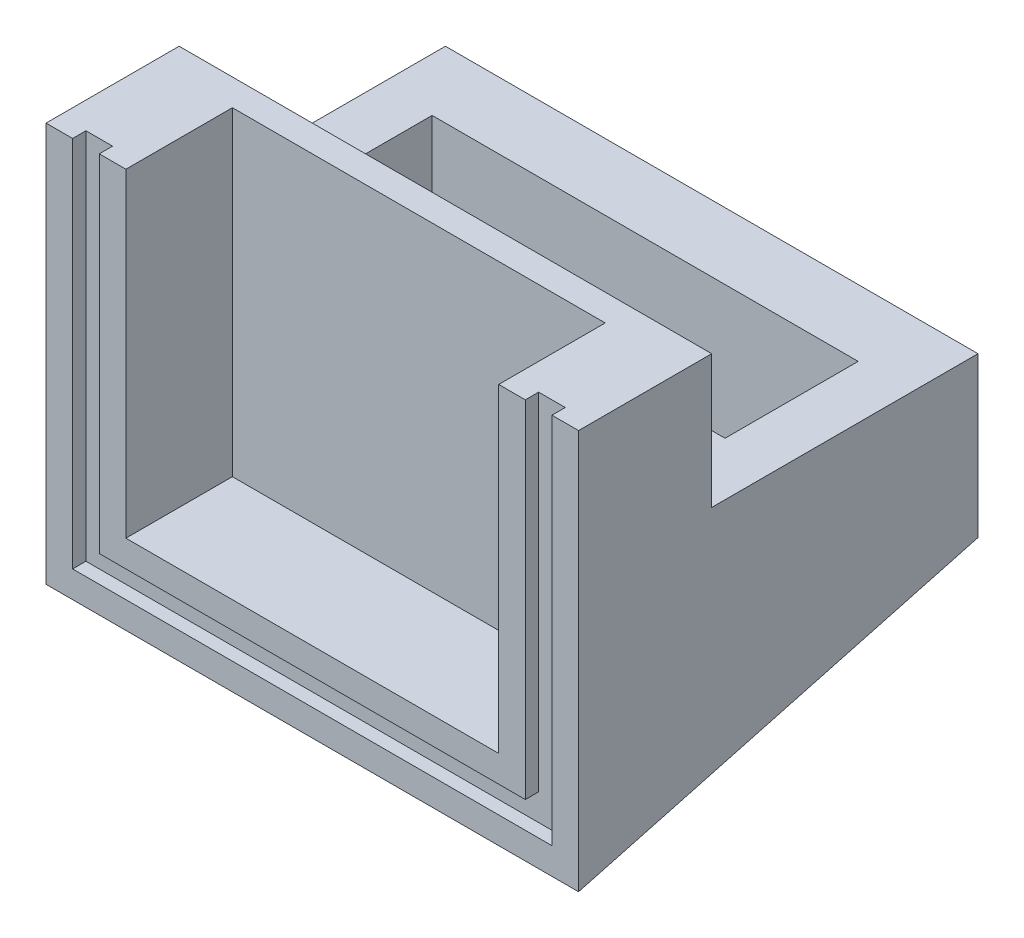
ISO-10303-21;
HEADER;
FILE_DESCRIPTION(('STEP AP214'),'2;1');
FILE_NAME('part.step','',(''),(''),'','','');
FILE_SCHEMA(('AUTOMOTIVE_DESIGN { 1 0 10303 214 1 1 1 1 }'));
ENDSEC;
DATA;
#1=APPLICATION_CONTEXT('core data for automotive mechanical design processes');
#2=APPLICATION_PROTOCOL_DEFINITION('international standard','automotive_design',2000,#1);
#3=PRODUCT_CONTEXT('',#1,'mechanical');
#4=PRODUCT('Part','Part','',(#3));
#5=PRODUCT_RELATED_PRODUCT_CATEGORY('part','',(#4));
#6=PRODUCT_DEFINITION_FORMATION('','',#4);
#7=PRODUCT_DEFINITION_CONTEXT('part definition',#1,'design');
#8=PRODUCT_DEFINITION('design','',#6,#7);
#9=PRODUCT_DEFINITION_SHAPE('','',#8);
#10=(LENGTH_UNIT() NAMED_UNIT(*) SI_UNIT(.MILLI.,.METRE.));
#11=(NAMED_UNIT(*) PLANE_ANGLE_UNIT() SI_UNIT($,.RADIAN.));
#12=(NAMED_UNIT(*) SI_UNIT($,.STERADIAN.) SOLID_ANGLE_UNIT());
#13=UNCERTAINTY_MEASURE_WITH_UNIT(LENGTH_MEASURE(1.E-05),#10,'distance_accuracy_value','');
#14=(GEOMETRIC_REPRESENTATION_CONTEXT(3) GLOBAL_UNCERTAINTY_ASSIGNED_CONTEXT((#13)) GLOBAL_UNIT_ASSIGNED_CONTEXT((#10,
#11,#12)) REPRESENTATION_CONTEXT('',''));
#15=CARTESIAN_POINT('',(0.,0.,0.));
#16=DIRECTION('',(0.,0.,1.));
#17=DIRECTION('',(1.,0.,0.));
#18=AXIS2_PLACEMENT_3D('',#15,#16,#17);
#19=CARTESIAN_POINT('',(10.,10.,5.));
#20=DIRECTION('',(-1.,0.,0.));
#21=DIRECTION('',(0.,0.,1.));
#22=AXIS2_PLACEMENT_3D('',#19,#20,#21);
#23=PLANE('',#22);
#24=DIRECTION('',(0.,0.258819045102522,-0.965925826289068));
#25=VECTOR('',#24,1.);
#26=CARTESIAN_POINT('',(10.,2.50000000000001,0.669872981077811));
#27=LINE('',#26,#25);
#28=CARTESIAN_POINT('',(10.,0.,10.));
#29=VERTEX_POINT('',#28);
#30=CARTESIAN_POINT('',(10.,4.01923788646685,-5.));
#31=VERTEX_POINT('',#30);
#32=EDGE_CURVE('E186',#29,#31,#27,.T.);
#33=ORIENTED_EDGE('',*,*,#32,.T.);
#34=DIRECTION('',(0.,-1.,0.));
#35=VECTOR('',#34,1.);
#36=CARTESIAN_POINT('',(10.,10.,-5.));
#37=LINE('',#36,#35);
#38=CARTESIAN_POINT('',(10.,10.,-5.));
#39=VERTEX_POINT('',#38);
#40=EDGE_CURVE('E11',#39,#31,#37,.T.);
#41=ORIENTED_EDGE('',*,*,#40,.F.);
#42=DIRECTION('',(0.,0.,-1.));
#43=VECTOR('',#42,1.);
#44=CARTESIAN_POINT('',(10.,10.,5.));
#45=LINE('',#44,#43);
#46=CARTESIAN_POINT('',(10.,10.,5.));
#47=VERTEX_POINT('',#46);
#48=EDGE_CURVE('E209',#47,#39,#45,.T.);
#49=ORIENTED_EDGE('',*,*,#48,.F.);
#50=DIRECTION('',(0.,1.,0.));
#51=VECTOR('',#50,1.);
#52=CARTESIAN_POINT('',(10.,15.,5.));
#53=LINE('',#52,#51);
#54=CARTESIAN_POINT('',(10.,15.,5.));
#55=VERTEX_POINT('',#54);
#56=EDGE_CURVE('E335',#47,#55,#53,.T.);
#57=ORIENTED_EDGE('',*,*,#56,.T.);
#58=DIRECTION('',(0.,0.,-1.));
#59=VECTOR('',#58,1.);
#60=CARTESIAN_POINT('',(10.,15.,10.));
#61=LINE('',#60,#59);
#62=CARTESIAN_POINT('',(10.,15.,10.));
#63=VERTEX_POINT('',#62);
#64=EDGE_CURVE('E336',#63,#55,#61,.T.);
#65=ORIENTED_EDGE('',*,*,#64,.F.);
#66=DIRECTION('',(0.,1.,0.));
#67=VECTOR('',#66,1.);
#68=CARTESIAN_POINT('',(10.,15.,10.));
#69=LINE('',#68,#67);
#70=EDGE_CURVE('E200',#29,#63,#69,.T.);
#71=ORIENTED_EDGE('',*,*,#70,.F.);
#72=EDGE_LOOP('',(#33,#41,#49,#57,#65,#71));
#73=FACE_BOUND('',#72,.T.);
#74=ADVANCED_FACE('F33',(#73),#23,.F.);
#75=CARTESIAN_POINT('',(-10.,10.,-5.));
#76=DIRECTION('',(0.,0.,1.));
#77=DIRECTION('',(1.,0.,0.));
#78=AXIS2_PLACEMENT_3D('',#75,#76,#77);
#79=PLANE('',#78);
#80=DIRECTION('',(1.,0.,0.));
#81=VECTOR('',#80,1.);
#82=CARTESIAN_POINT('',(-10.00005,4.01923788646685,-5.));
#83=LINE('',#82,#81);
#84=CARTESIAN_POINT('',(-10.,4.01923788646685,-5.));
#85=VERTEX_POINT('',#84);
#86=EDGE_CURVE('E183',#85,#31,#83,.T.);
#87=ORIENTED_EDGE('',*,*,#86,.F.);
#88=DIRECTION('',(0.,-1.,0.));
#89=VECTOR('',#88,1.);
#90=CARTESIAN_POINT('',(-10.,10.,-5.));
#91=LINE('',#90,#89);
#92=CARTESIAN_POINT('',(-10.,10.,-5.));
#93=VERTEX_POINT('',#92);
#94=EDGE_CURVE('E41',#93,#85,#91,.T.);
#95=ORIENTED_EDGE('',*,*,#94,.F.);
#96=DIRECTION('',(-1.,0.,0.));
#97=VECTOR('',#96,1.);
#98=CARTESIAN_POINT('',(-10.,10.,-5.));
#99=LINE('',#98,#97);
#100=EDGE_CURVE('E203',#39,#93,#99,.T.);
#101=ORIENTED_EDGE('',*,*,#100,.F.);
#102=ORIENTED_EDGE('',*,*,#40,.T.);
#103=EDGE_LOOP('',(#87,#95,#101,#102));
#104=FACE_BOUND('',#103,.T.);
#105=ADVANCED_FACE('F202',(#104),#79,.F.);
#106=CARTESIAN_POINT('',(-10.,10.,5.));
#107=DIRECTION('',(1.,0.,0.));
#108=DIRECTION('',(0.,0.,-1.));
#109=AXIS2_PLACEMENT_3D('',#106,#107,#108);
#110=PLANE('',#109);
#111=DIRECTION('',(0.,0.258819045102522,-0.965925826289068));
#112=VECTOR('',#111,1.);
#113=CARTESIAN_POINT('',(-10.,1.91987298107781,2.8349364905389));
#114=LINE('',#113,#112);
#115=CARTESIAN_POINT('',(-10.0000025,0.,10.));
#116=VERTEX_POINT('',#115);
#117=EDGE_CURVE('E189',#116,#85,#114,.T.);
#118=ORIENTED_EDGE('',*,*,#117,.F.);
#119=DIRECTION('',(0.,-1.,0.));
#120=VECTOR('',#119,1.);
#121=CARTESIAN_POINT('',(-10.,15.,10.));
#122=LINE('',#121,#120);
#123=CARTESIAN_POINT('',(-10.,15.,10.));
#124=VERTEX_POINT('',#123);
#125=EDGE_CURVE('E373',#124,#116,#122,.T.);
#126=ORIENTED_EDGE('',*,*,#125,.F.);
#127=DIRECTION('',(0.,0.,-1.));
#128=VECTOR('',#127,1.);
#129=CARTESIAN_POINT('',(-10.,15.,10.));
#130=LINE('',#129,#128);
#131=CARTESIAN_POINT('',(-10.,15.,5.));
#132=VERTEX_POINT('',#131);
#133=EDGE_CURVE('E324',#124,#132,#130,.T.);
#134=ORIENTED_EDGE('',*,*,#133,.T.);
#135=DIRECTION('',(0.,-1.,0.));
#136=VECTOR('',#135,1.);
#137=CARTESIAN_POINT('',(-10.,15.,5.));
#138=LINE('',#137,#136);
#139=CARTESIAN_POINT('',(-10.,10.,5.));
#140=VERTEX_POINT('',#139);
#141=EDGE_CURVE('E312',#132,#140,#138,.T.);
#142=ORIENTED_EDGE('',*,*,#141,.T.);
#143=DIRECTION('',(0.,0.,1.));
#144=VECTOR('',#143,1.);
#145=CARTESIAN_POINT('',(-10.,10.,5.));
#146=LINE('',#145,#144);
#147=EDGE_CURVE('E208',#93,#140,#146,.T.);
#148=ORIENTED_EDGE('',*,*,#147,.F.);
#149=ORIENTED_EDGE('',*,*,#94,.T.);
#150=EDGE_LOOP('',(#118,#126,#134,#142,#148,#149));
#151=FACE_BOUND('',#150,.T.);
#152=ADVANCED_FACE('F359',(#151),#110,.F.);
#153=CARTESIAN_POINT('',(8.,0.,2.5));
#154=DIRECTION('',(1.,0.,0.));
#155=DIRECTION('',(0.,0.,-1.));
#156=AXIS2_PLACEMENT_3D('',#153,#154,#155);
#157=PLANE('',#156);
#158=DIRECTION('',(0.,0.258819045102522,-0.965925826289068));
#159=VECTOR('',#158,1.);
#160=CARTESIAN_POINT('',(8.,1.87500000000001,3.00240473580836));
#161=LINE('',#160,#159);
#162=CARTESIAN_POINT('',(8.,2.00961894323343,2.5));
#163=VERTEX_POINT('',#162);
#164=CARTESIAN_POINT('',(8.,3.34936490538905,-2.5));
#165=VERTEX_POINT('',#164);
#166=EDGE_CURVE('E49',#163,#165,#161,.T.);
#167=ORIENTED_EDGE('',*,*,#166,.F.);
#168=DIRECTION('',(0.,1.,0.));
#169=VECTOR('',#168,1.);
#170=CARTESIAN_POINT('',(8.,0.,2.5));
#171=LINE('',#170,#169);
#172=CARTESIAN_POINT('',(8.,10.,2.5));
#173=VERTEX_POINT('',#172);
#174=EDGE_CURVE('E214',#163,#173,#171,.T.);
#175=ORIENTED_EDGE('',*,*,#174,.T.);
#176=DIRECTION('',(0.,0.,-1.));
#177=VECTOR('',#176,1.);
#178=CARTESIAN_POINT('',(8.,10.,2.5));
#179=LINE('',#178,#177);
#180=CARTESIAN_POINT('',(8.,10.,-2.5));
#181=VERTEX_POINT('',#180);
#182=EDGE_CURVE('E340',#173,#181,#179,.T.);
#183=ORIENTED_EDGE('',*,*,#182,.T.);
#184=DIRECTION('',(0.,1.,0.));
#185=VECTOR('',#184,1.);
#186=CARTESIAN_POINT('',(8.,0.,-2.5));
#187=LINE('',#186,#185);
#188=EDGE_CURVE('E351',#165,#181,#187,.T.);
#189=ORIENTED_EDGE('',*,*,#188,.F.);
#190=EDGE_LOOP('',(#167,#175,#183,#189));
#191=FACE_BOUND('',#190,.T.);
#192=ADVANCED_FACE('F438',(#191),#157,.F.);
#193=CARTESIAN_POINT('',(-8.,0.,2.5));
#194=DIRECTION('',(0.,0.,1.));
#195=DIRECTION('',(1.,0.,0.));
#196=AXIS2_PLACEMENT_3D('',#193,#194,#195);
#197=PLANE('',#196);
#198=DIRECTION('',(1.,0.,0.));
#199=VECTOR('',#198,1.);
#200=CARTESIAN_POINT('',(-8.,2.00961894323343,2.5));
#201=LINE('',#200,#199);
#202=CARTESIAN_POINT('',(-8.,2.00961894323343,2.5));
#203=VERTEX_POINT('',#202);
#204=EDGE_CURVE('E636',#203,#163,#201,.T.);
#205=ORIENTED_EDGE('',*,*,#204,.F.);
#206=DIRECTION('',(0.,1.,0.));
#207=VECTOR('',#206,1.);
#208=CARTESIAN_POINT('',(-8.,0.,2.5));
#209=LINE('',#208,#207);
#210=CARTESIAN_POINT('',(-8.,10.,2.5));
#211=VERTEX_POINT('',#210);
#212=EDGE_CURVE('E216',#203,#211,#209,.T.);
#213=ORIENTED_EDGE('',*,*,#212,.T.);
#214=DIRECTION('',(1.,0.,0.));
#215=VECTOR('',#214,1.);
#216=CARTESIAN_POINT('',(-8.,10.,2.5));
#217=LINE('',#216,#215);
#218=EDGE_CURVE('E349',#211,#173,#217,.T.);
#219=ORIENTED_EDGE('',*,*,#218,.T.);
#220=ORIENTED_EDGE('',*,*,#174,.F.);
#221=EDGE_LOOP('',(#205,#213,#219,#220));
#222=FACE_BOUND('',#221,.T.);
#223=ADVANCED_FACE('F446',(#222),#197,.F.);
#224=CARTESIAN_POINT('',(-8.,0.,2.5));
#225=DIRECTION('',(-1.,0.,0.));
#226=DIRECTION('',(0.,0.,1.));
#227=AXIS2_PLACEMENT_3D('',#224,#225,#226);
#228=PLANE('',#227);
#229=DIRECTION('',(0.,-0.258819045102522,0.965925826289068));
#230=VECTOR('',#229,1.);
#231=CARTESIAN_POINT('',(-8.,1.87500000000001,3.00240473580836));
#232=LINE('',#231,#230);
#233=CARTESIAN_POINT('',(-8.,3.34936490538905,-2.5));
#234=VERTEX_POINT('',#233);
#235=EDGE_CURVE('E638',#234,#203,#232,.T.);
#236=ORIENTED_EDGE('',*,*,#235,.F.);
#237=DIRECTION('',(0.,1.,0.));
#238=VECTOR('',#237,1.);
#239=CARTESIAN_POINT('',(-8.,0.,-2.5));
#240=LINE('',#239,#238);
#241=CARTESIAN_POINT('',(-8.,10.,-2.5));
#242=VERTEX_POINT('',#241);
#243=EDGE_CURVE('E354',#234,#242,#240,.T.);
#244=ORIENTED_EDGE('',*,*,#243,.T.);
#245=DIRECTION('',(0.,0.,1.));
#246=VECTOR('',#245,1.);
#247=CARTESIAN_POINT('',(-8.,10.,2.5));
#248=LINE('',#247,#246);
#249=EDGE_CURVE('E346',#242,#211,#248,.T.);
#250=ORIENTED_EDGE('',*,*,#249,.T.);
#251=ORIENTED_EDGE('',*,*,#212,.F.);
#252=EDGE_LOOP('',(#236,#244,#250,#251));
#253=FACE_BOUND('',#252,.T.);
#254=ADVANCED_FACE('F451',(#253),#228,.F.);
#255=CARTESIAN_POINT('',(-8.,0.,-2.5));
#256=DIRECTION('',(0.,0.,-1.));
#257=DIRECTION('',(-1.,0.,0.));
#258=AXIS2_PLACEMENT_3D('',#255,#256,#257);
#259=PLANE('',#258);
#260=DIRECTION('',(-1.,0.,0.));
#261=VECTOR('',#260,1.);
#262=CARTESIAN_POINT('',(-8.,3.34936490538905,-2.5));
#263=LINE('',#262,#261);
#264=EDGE_CURVE('E193',#165,#234,#263,.T.);
#265=ORIENTED_EDGE('',*,*,#264,.F.);
#266=ORIENTED_EDGE('',*,*,#188,.T.);
#267=DIRECTION('',(-1.,0.,0.));
#268=VECTOR('',#267,1.);
#269=CARTESIAN_POINT('',(-8.,10.,-2.5));
#270=LINE('',#269,#268);
#271=EDGE_CURVE('E343',#181,#242,#270,.T.);
#272=ORIENTED_EDGE('',*,*,#271,.T.);
#273=ORIENTED_EDGE('',*,*,#243,.F.);
#274=EDGE_LOOP('',(#265,#266,#272,#273));
#275=FACE_BOUND('',#274,.T.);
#276=ADVANCED_FACE('F448',(#275),#259,.F.);
#277=CARTESIAN_POINT('',(0.,0.,10.));
#278=DIRECTION('',(0.,0.,-1.));
#279=DIRECTION('',(-1.,0.,0.));
#280=AXIS2_PLACEMENT_3D('',#277,#278,#279);
#281=PLANE('',#280);
#282=DIRECTION('',(-1.,0.,0.));
#283=VECTOR('',#282,1.);
#284=CARTESIAN_POINT('',(10.,15.,10.));
#285=LINE('',#284,#283);
#286=CARTESIAN_POINT('',(-7.,15.,10.));
#287=VERTEX_POINT('',#286);
#288=CARTESIAN_POINT('',(-8.,15.,10.));
#289=VERTEX_POINT('',#288);
#290=EDGE_CURVE('E326',#287,#289,#285,.T.);
#291=ORIENTED_EDGE('',*,*,#290,.T.);
#292=DIRECTION('',(0.,1.,0.));
#293=VECTOR('',#292,1.);
#294=CARTESIAN_POINT('',(-8.,15.,10.));
#295=LINE('',#294,#293);
#296=CARTESIAN_POINT('',(-8.,2.,10.));
#297=VERTEX_POINT('',#296);
#298=EDGE_CURVE('E239',#297,#289,#295,.T.);
#299=ORIENTED_EDGE('',*,*,#298,.F.);
#300=DIRECTION('',(-1.,0.,0.));
#301=VECTOR('',#300,1.);
#302=CARTESIAN_POINT('',(-8.,2.,10.));
#303=LINE('',#302,#301);
#304=CARTESIAN_POINT('',(8.,2.,10.));
#305=VERTEX_POINT('',#304);
#306=EDGE_CURVE('E267',#305,#297,#303,.T.);
#307=ORIENTED_EDGE('',*,*,#306,.F.);
#308=DIRECTION('',(0.,-1.,0.));
#309=VECTOR('',#308,1.);
#310=CARTESIAN_POINT('',(8.,15.,10.));
#311=LINE('',#310,#309);
#312=CARTESIAN_POINT('',(8.,15.,10.));
#313=VERTEX_POINT('',#312);
#314=EDGE_CURVE('E264',#313,#305,#311,.T.);
#315=ORIENTED_EDGE('',*,*,#314,.F.);
#316=CARTESIAN_POINT('',(7.,15.,10.));
#317=VERTEX_POINT('',#316);
#318=EDGE_CURVE('E325',#313,#317,#285,.T.);
#319=ORIENTED_EDGE('',*,*,#318,.T.);
#320=DIRECTION('',(0.,1.,0.));
#321=VECTOR('',#320,1.);
#322=CARTESIAN_POINT('',(7.,3.,10.));
#323=LINE('',#322,#321);
#324=CARTESIAN_POINT('',(7.,3.,10.));
#325=VERTEX_POINT('',#324);
#326=EDGE_CURVE('E274',#325,#317,#323,.T.);
#327=ORIENTED_EDGE('',*,*,#326,.F.);
#328=DIRECTION('',(1.,0.,0.));
#329=VECTOR('',#328,1.);
#330=CARTESIAN_POINT('',(7.,3.,10.));
#331=LINE('',#330,#329);
#332=CARTESIAN_POINT('',(-7.,3.,10.));
#333=VERTEX_POINT('',#332);
#334=EDGE_CURVE('E293',#333,#325,#331,.T.);
#335=ORIENTED_EDGE('',*,*,#334,.F.);
#336=DIRECTION('',(0.,-1.,0.));
#337=VECTOR('',#336,1.);
#338=CARTESIAN_POINT('',(-7.,3.,10.));
#339=LINE('',#338,#337);
#340=EDGE_CURVE('E305',#287,#333,#339,.T.);
#341=ORIENTED_EDGE('',*,*,#340,.F.);
#342=EDGE_LOOP('',(#291,#299,#307,#315,#319,#327,#335,#341));
#343=FACE_BOUND('',#342,.T.);
#344=ADVANCED_FACE('F397',(#343),#281,.F.);
#345=CARTESIAN_POINT('',(0.,10.,0.));
#346=DIRECTION('',(0.,-1.,0.));
#347=DIRECTION('',(0.,0.,-1.));
#348=AXIS2_PLACEMENT_3D('',#345,#346,#347);
#349=PLANE('',#348);
#350=ORIENTED_EDGE('',*,*,#271,.F.);
#351=ORIENTED_EDGE('',*,*,#182,.F.);
#352=ORIENTED_EDGE('',*,*,#218,.F.);
#353=ORIENTED_EDGE('',*,*,#249,.F.);
#354=EDGE_LOOP('',(#350,#351,#352,#353));
#355=FACE_BOUND('',#354,.T.);
#356=ORIENTED_EDGE('',*,*,#48,.T.);
#357=ORIENTED_EDGE('',*,*,#100,.T.);
#358=ORIENTED_EDGE('',*,*,#147,.T.);
#359=DIRECTION('',(1.,0.,0.));
#360=VECTOR('',#359,1.);
#361=CARTESIAN_POINT('',(-10.,10.,5.));
#362=LINE('',#361,#360);
#363=EDGE_CURVE('E213',#140,#47,#362,.T.);
#364=ORIENTED_EDGE('',*,*,#363,.T.);
#365=EDGE_LOOP('',(#356,#357,#358,#364));
#366=FACE_BOUND('',#365,.T.);
#367=ADVANCED_FACE('F212',(#355,#366),#349,.F.);
#368=CARTESIAN_POINT('',(0.,0.,5.));
#369=DIRECTION('',(0.,0.,-1.));
#370=DIRECTION('',(-1.,0.,0.));
#371=AXIS2_PLACEMENT_3D('',#368,#369,#370);
#372=PLANE('',#371);
#373=ORIENTED_EDGE('',*,*,#363,.F.);
#374=ORIENTED_EDGE('',*,*,#141,.F.);
#375=DIRECTION('',(-1.,0.,0.));
#376=VECTOR('',#375,1.);
#377=CARTESIAN_POINT('',(10.,15.,5.));
#378=LINE('',#377,#376);
#379=EDGE_CURVE('E339',#55,#132,#378,.T.);
#380=ORIENTED_EDGE('',*,*,#379,.F.);
#381=ORIENTED_EDGE('',*,*,#56,.F.);
#382=EDGE_LOOP('',(#373,#374,#380,#381));
#383=FACE_BOUND('',#382,.T.);
#384=ADVANCED_FACE('F367',(#383),#372,.T.);
#385=CARTESIAN_POINT('',(10.,15.,10.));
#386=DIRECTION('',(0.,-1.,0.));
#387=DIRECTION('',(1.,0.,0.));
#388=AXIS2_PLACEMENT_3D('',#385,#386,#387);
#389=PLANE('',#388);
#390=DIRECTION('',(-1.,0.,0.));
#391=VECTOR('',#390,1.);
#392=CARTESIAN_POINT('',(-9.,15.,9.5));
#393=LINE('',#392,#391);
#394=CARTESIAN_POINT('',(-8.,15.,9.5));
#395=VERTEX_POINT('',#394);
#396=CARTESIAN_POINT('',(-9.,15.,9.5));
#397=VERTEX_POINT('',#396);
#398=EDGE_CURVE('E235',#395,#397,#393,.T.);
#399=ORIENTED_EDGE('',*,*,#398,.F.);
#400=DIRECTION('',(0.,0.,1.));
#401=VECTOR('',#400,1.);
#402=CARTESIAN_POINT('',(-8.,15.,9.5));
#403=LINE('',#402,#401);
#404=EDGE_CURVE('E271',#395,#289,#403,.T.);
#405=ORIENTED_EDGE('',*,*,#404,.T.);
#406=ORIENTED_EDGE('',*,*,#290,.F.);
#407=DIRECTION('',(0.,0.,1.));
#408=VECTOR('',#407,1.);
#409=CARTESIAN_POINT('',(-7.,15.,6.));
#410=LINE('',#409,#408);
#411=CARTESIAN_POINT('',(-7.,15.,6.));
#412=VERTEX_POINT('',#411);
#413=EDGE_CURVE('E315',#412,#287,#410,.T.);
#414=ORIENTED_EDGE('',*,*,#413,.F.);
#415=DIRECTION('',(-1.,0.,0.));
#416=VECTOR('',#415,1.);
#417=CARTESIAN_POINT('',(-7.,15.,6.));
#418=LINE('',#417,#416);
#419=CARTESIAN_POINT('',(7.,15.,6.));
#420=VERTEX_POINT('',#419);
#421=EDGE_CURVE('E292',#420,#412,#418,.T.);
#422=ORIENTED_EDGE('',*,*,#421,.F.);
#423=DIRECTION('',(0.,0.,1.));
#424=VECTOR('',#423,1.);
#425=CARTESIAN_POINT('',(7.,15.,6.));
#426=LINE('',#425,#424);
#427=EDGE_CURVE('E302',#420,#317,#426,.T.);
#428=ORIENTED_EDGE('',*,*,#427,.T.);
#429=ORIENTED_EDGE('',*,*,#318,.F.);
#430=DIRECTION('',(0.,0.,1.));
#431=VECTOR('',#430,1.);
#432=CARTESIAN_POINT('',(8.,15.,9.5));
#433=LINE('',#432,#431);
#434=CARTESIAN_POINT('',(8.,15.,9.5));
#435=VERTEX_POINT('',#434);
#436=EDGE_CURVE('E279',#435,#313,#433,.T.);
#437=ORIENTED_EDGE('',*,*,#436,.F.);
#438=DIRECTION('',(-1.,0.,0.));
#439=VECTOR('',#438,1.);
#440=CARTESIAN_POINT('',(9.,15.,9.5));
#441=LINE('',#440,#439);
#442=CARTESIAN_POINT('',(9.,15.,9.5));
#443=VERTEX_POINT('',#442);
#444=EDGE_CURVE('E247',#443,#435,#441,.T.);
#445=ORIENTED_EDGE('',*,*,#444,.F.);
#446=DIRECTION('',(0.,0.,1.));
#447=VECTOR('',#446,1.);
#448=CARTESIAN_POINT('',(9.,15.,9.5));
#449=LINE('',#448,#447);
#450=CARTESIAN_POINT('',(9.,15.,10.));
#451=VERTEX_POINT('',#450);
#452=EDGE_CURVE('E281',#443,#451,#449,.T.);
#453=ORIENTED_EDGE('',*,*,#452,.T.);
#454=EDGE_CURVE('E321',#63,#451,#285,.T.);
#455=ORIENTED_EDGE('',*,*,#454,.F.);
#456=ORIENTED_EDGE('',*,*,#64,.T.);
#457=ORIENTED_EDGE('',*,*,#379,.T.);
#458=ORIENTED_EDGE('',*,*,#133,.F.);
#459=CARTESIAN_POINT('',(-9.,15.,10.));
#460=VERTEX_POINT('',#459);
#461=EDGE_CURVE('E320',#460,#124,#285,.T.);
#462=ORIENTED_EDGE('',*,*,#461,.F.);
#463=DIRECTION('',(0.,0.,1.));
#464=VECTOR('',#463,1.);
#465=CARTESIAN_POINT('',(-9.,15.,9.5));
#466=LINE('',#465,#464);
#467=EDGE_CURVE('E57',#397,#460,#466,.T.);
#468=ORIENTED_EDGE('',*,*,#467,.F.);
#469=EDGE_LOOP('',(#399,#405,#406,#414,#422,#428,#429,#437,#445,#453,#455,#456,#457,#458,#462,#468));
#470=FACE_BOUND('',#469,.T.);
#471=ADVANCED_FACE('F372',(#470),#389,.F.);
#472=ORIENTED_EDGE('',*,*,#454,.T.);
#473=DIRECTION('',(0.,1.,0.));
#474=VECTOR('',#473,1.);
#475=CARTESIAN_POINT('',(9.,15.,10.));
#476=LINE('',#475,#474);
#477=CARTESIAN_POINT('',(9.,0.999999999999999,10.));
#478=VERTEX_POINT('',#477);
#479=EDGE_CURVE('E262',#478,#451,#476,.T.);
#480=ORIENTED_EDGE('',*,*,#479,.F.);
#481=DIRECTION('',(1.,0.,0.));
#482=VECTOR('',#481,1.);
#483=CARTESIAN_POINT('',(9.,0.999999999999999,10.));
#484=LINE('',#483,#482);
#485=CARTESIAN_POINT('',(-9.,1.,10.));
#486=VERTEX_POINT('',#485);
#487=EDGE_CURVE('E259',#486,#478,#484,.T.);
#488=ORIENTED_EDGE('',*,*,#487,.F.);
#489=DIRECTION('',(0.,-1.,0.));
#490=VECTOR('',#489,1.);
#491=CARTESIAN_POINT('',(-9.,15.,10.));
#492=LINE('',#491,#490);
#493=EDGE_CURVE('E233',#460,#486,#492,.T.);
#494=ORIENTED_EDGE('',*,*,#493,.F.);
#495=ORIENTED_EDGE('',*,*,#461,.T.);
#496=ORIENTED_EDGE('',*,*,#125,.T.);
#497=DIRECTION('',(1.,0.,0.));
#498=VECTOR('',#497,1.);
#499=CARTESIAN_POINT('',(10.,0.,10.));
#500=LINE('',#499,#498);
#501=EDGE_CURVE('E228',#116,#29,#500,.T.);
#502=ORIENTED_EDGE('',*,*,#501,.T.);
#503=ORIENTED_EDGE('',*,*,#70,.T.);
#504=EDGE_LOOP('',(#472,#480,#488,#494,#495,#496,#502,#503));
#505=FACE_BOUND('',#504,.T.);
#506=ADVANCED_FACE('F376',(#505),#281,.F.);
#507=CARTESIAN_POINT('',(7.,3.,6.));
#508=DIRECTION('',(1.,0.,0.));
#509=DIRECTION('',(0.,1.,0.));
#510=AXIS2_PLACEMENT_3D('',#507,#508,#509);
#511=PLANE('',#510);
#512=ORIENTED_EDGE('',*,*,#326,.T.);
#513=ORIENTED_EDGE('',*,*,#427,.F.);
#514=DIRECTION('',(0.,1.,0.));
#515=VECTOR('',#514,1.);
#516=CARTESIAN_POINT('',(7.,3.,6.));
#517=LINE('',#516,#515);
#518=CARTESIAN_POINT('',(7.,3.,6.));
#519=VERTEX_POINT('',#518);
#520=EDGE_CURVE('E289',#519,#420,#517,.T.);
#521=ORIENTED_EDGE('',*,*,#520,.F.);
#522=DIRECTION('',(0.,0.,1.));
#523=VECTOR('',#522,1.);
#524=CARTESIAN_POINT('',(7.,3.,6.));
#525=LINE('',#524,#523);
#526=EDGE_CURVE('E310',#519,#325,#525,.T.);
#527=ORIENTED_EDGE('',*,*,#526,.T.);
#528=EDGE_LOOP('',(#512,#513,#521,#527));
#529=FACE_BOUND('',#528,.T.);
#530=ADVANCED_FACE('F401',(#529),#511,.F.);
#531=CARTESIAN_POINT('',(7.,3.,6.));
#532=DIRECTION('',(0.,-1.,0.));
#533=DIRECTION('',(0.,0.,-1.));
#534=AXIS2_PLACEMENT_3D('',#531,#532,#533);
#535=PLANE('',#534);
#536=ORIENTED_EDGE('',*,*,#334,.T.);
#537=ORIENTED_EDGE('',*,*,#526,.F.);
#538=DIRECTION('',(1.,0.,0.));
#539=VECTOR('',#538,1.);
#540=CARTESIAN_POINT('',(7.,3.,6.));
#541=LINE('',#540,#539);
#542=CARTESIAN_POINT('',(-7.,3.,6.));
#543=VERTEX_POINT('',#542);
#544=EDGE_CURVE('E299',#543,#519,#541,.T.);
#545=ORIENTED_EDGE('',*,*,#544,.F.);
#546=DIRECTION('',(0.,0.,1.));
#547=VECTOR('',#546,1.);
#548=CARTESIAN_POINT('',(-7.,3.,6.));
#549=LINE('',#548,#547);
#550=EDGE_CURVE('E313',#543,#333,#549,.T.);
#551=ORIENTED_EDGE('',*,*,#550,.T.);
#552=EDGE_LOOP('',(#536,#537,#545,#551));
#553=FACE_BOUND('',#552,.T.);
#554=ADVANCED_FACE('F410',(#553),#535,.F.);
#555=CARTESIAN_POINT('',(-7.,3.,6.));
#556=DIRECTION('',(-1.,0.,0.));
#557=DIRECTION('',(0.,-1.,0.));
#558=AXIS2_PLACEMENT_3D('',#555,#556,#557);
#559=PLANE('',#558);
#560=ORIENTED_EDGE('',*,*,#340,.T.);
#561=ORIENTED_EDGE('',*,*,#550,.F.);
#562=DIRECTION('',(0.,-1.,0.));
#563=VECTOR('',#562,1.);
#564=CARTESIAN_POINT('',(-7.,3.,6.));
#565=LINE('',#564,#563);
#566=EDGE_CURVE('E296',#412,#543,#565,.T.);
#567=ORIENTED_EDGE('',*,*,#566,.F.);
#568=ORIENTED_EDGE('',*,*,#413,.T.);
#569=EDGE_LOOP('',(#560,#561,#567,#568));
#570=FACE_BOUND('',#569,.T.);
#571=ADVANCED_FACE('F467',(#570),#559,.F.);
#572=CARTESIAN_POINT('',(0.,0.,6.));
#573=DIRECTION('',(0.,0.,-1.));
#574=DIRECTION('',(-1.,0.,0.));
#575=AXIS2_PLACEMENT_3D('',#572,#573,#574);
#576=PLANE('',#575);
#577=ORIENTED_EDGE('',*,*,#520,.T.);
#578=ORIENTED_EDGE('',*,*,#421,.T.);
#579=ORIENTED_EDGE('',*,*,#566,.T.);
#580=ORIENTED_EDGE('',*,*,#544,.T.);
#581=EDGE_LOOP('',(#577,#578,#579,#580));
#582=FACE_BOUND('',#581,.T.);
#583=ADVANCED_FACE('F407',(#582),#576,.F.);
#584=CARTESIAN_POINT('',(-8.,15.,9.5));
#585=DIRECTION('',(1.,0.,0.));
#586=DIRECTION('',(0.,0.,-1.));
#587=AXIS2_PLACEMENT_3D('',#584,#585,#586);
#588=PLANE('',#587);
#589=ORIENTED_EDGE('',*,*,#298,.T.);
#590=ORIENTED_EDGE('',*,*,#404,.F.);
#591=DIRECTION('',(0.,1.,0.));
#592=VECTOR('',#591,1.);
#593=CARTESIAN_POINT('',(-8.,15.,9.5));
#594=LINE('',#593,#592);
#595=CARTESIAN_POINT('',(-8.,2.,9.5));
#596=VERTEX_POINT('',#595);
#597=EDGE_CURVE('E255',#596,#395,#594,.T.);
#598=ORIENTED_EDGE('',*,*,#597,.F.);
#599=DIRECTION('',(0.,0.,1.));
#600=VECTOR('',#599,1.);
#601=CARTESIAN_POINT('',(-8.,2.,9.5));
#602=LINE('',#601,#600);
#603=EDGE_CURVE('E275',#596,#297,#602,.T.);
#604=ORIENTED_EDGE('',*,*,#603,.T.);
#605=EDGE_LOOP('',(#589,#590,#598,#604));
#606=FACE_BOUND('',#605,.T.);
#607=ADVANCED_FACE('F416',(#606),#588,.F.);
#608=CARTESIAN_POINT('',(-8.,2.,9.5));
#609=DIRECTION('',(0.,1.,0.));
#610=DIRECTION('',(0.,0.,1.));
#611=AXIS2_PLACEMENT_3D('',#608,#609,#610);
#612=PLANE('',#611);
#613=ORIENTED_EDGE('',*,*,#306,.T.);
#614=ORIENTED_EDGE('',*,*,#603,.F.);
#615=DIRECTION('',(-1.,0.,0.));
#616=VECTOR('',#615,1.);
#617=CARTESIAN_POINT('',(8.,2.,9.5));
#618=LINE('',#617,#616);
#619=CARTESIAN_POINT('',(8.,2.,9.5));
#620=VERTEX_POINT('',#619);
#621=EDGE_CURVE('E253',#620,#596,#618,.T.);
#622=ORIENTED_EDGE('',*,*,#621,.F.);
#623=DIRECTION('',(0.,0.,1.));
#624=VECTOR('',#623,1.);
#625=CARTESIAN_POINT('',(8.,2.,9.5));
#626=LINE('',#625,#624);
#627=EDGE_CURVE('E277',#620,#305,#626,.T.);
#628=ORIENTED_EDGE('',*,*,#627,.T.);
#629=EDGE_LOOP('',(#613,#614,#622,#628));
#630=FACE_BOUND('',#629,.T.);
#631=ADVANCED_FACE('F420',(#630),#612,.F.);
#632=CARTESIAN_POINT('',(8.,15.,9.5));
#633=DIRECTION('',(-1.,0.,0.));
#634=DIRECTION('',(0.,0.,1.));
#635=AXIS2_PLACEMENT_3D('',#632,#633,#634);
#636=PLANE('',#635);
#637=ORIENTED_EDGE('',*,*,#314,.T.);
#638=ORIENTED_EDGE('',*,*,#627,.F.);
#639=DIRECTION('',(0.,-1.,0.));
#640=VECTOR('',#639,1.);
#641=CARTESIAN_POINT('',(8.,15.,9.5));
#642=LINE('',#641,#640);
#643=EDGE_CURVE('E250',#435,#620,#642,.T.);
#644=ORIENTED_EDGE('',*,*,#643,.F.);
#645=ORIENTED_EDGE('',*,*,#436,.T.);
#646=EDGE_LOOP('',(#637,#638,#644,#645));
#647=FACE_BOUND('',#646,.T.);
#648=ADVANCED_FACE('F422',(#647),#636,.F.);
#649=CARTESIAN_POINT('',(9.,15.,9.5));
#650=DIRECTION('',(1.,0.,0.));
#651=DIRECTION('',(0.,0.,-1.));
#652=AXIS2_PLACEMENT_3D('',#649,#650,#651);
#653=PLANE('',#652);
#654=ORIENTED_EDGE('',*,*,#479,.T.);
#655=ORIENTED_EDGE('',*,*,#452,.F.);
#656=DIRECTION('',(0.,1.,0.));
#657=VECTOR('',#656,1.);
#658=CARTESIAN_POINT('',(9.,15.,9.5));
#659=LINE('',#658,#657);
#660=CARTESIAN_POINT('',(9.,0.999999999999999,9.5));
#661=VERTEX_POINT('',#660);
#662=EDGE_CURVE('E244',#661,#443,#659,.T.);
#663=ORIENTED_EDGE('',*,*,#662,.F.);
#664=DIRECTION('',(0.,0.,1.));
#665=VECTOR('',#664,1.);
#666=CARTESIAN_POINT('',(9.,0.999999999999999,9.5));
#667=LINE('',#666,#665);
#668=EDGE_CURVE('E284',#661,#478,#667,.T.);
#669=ORIENTED_EDGE('',*,*,#668,.T.);
#670=EDGE_LOOP('',(#654,#655,#663,#669));
#671=FACE_BOUND('',#670,.T.);
#672=ADVANCED_FACE('F380',(#671),#653,.F.);
#673=CARTESIAN_POINT('',(9.,0.999999999999999,9.5));
#674=DIRECTION('',(0.,-1.,0.));
#675=DIRECTION('',(1.,0.,0.));
#676=AXIS2_PLACEMENT_3D('',#673,#674,#675);
#677=PLANE('',#676);
#678=ORIENTED_EDGE('',*,*,#487,.T.);
#679=ORIENTED_EDGE('',*,*,#668,.F.);
#680=DIRECTION('',(1.,0.,0.));
#681=VECTOR('',#680,1.);
#682=CARTESIAN_POINT('',(-9.,1.,9.5));
#683=LINE('',#682,#681);
#684=CARTESIAN_POINT('',(-9.,1.,9.5));
#685=VERTEX_POINT('',#684);
#686=EDGE_CURVE('E242',#685,#661,#683,.T.);
#687=ORIENTED_EDGE('',*,*,#686,.F.);
#688=DIRECTION('',(0.,0.,1.));
#689=VECTOR('',#688,1.);
#690=CARTESIAN_POINT('',(-9.,1.,9.5));
#691=LINE('',#690,#689);
#692=EDGE_CURVE('E286',#685,#486,#691,.T.);
#693=ORIENTED_EDGE('',*,*,#692,.T.);
#694=EDGE_LOOP('',(#678,#679,#687,#693));
#695=FACE_BOUND('',#694,.T.);
#696=ADVANCED_FACE('F390',(#695),#677,.F.);
#697=CARTESIAN_POINT('',(-9.,15.,9.5));
#698=DIRECTION('',(-1.,0.,0.));
#699=DIRECTION('',(0.,0.,1.));
#700=AXIS2_PLACEMENT_3D('',#697,#698,#699);
#701=PLANE('',#700);
#702=ORIENTED_EDGE('',*,*,#493,.T.);
#703=ORIENTED_EDGE('',*,*,#692,.F.);
#704=DIRECTION('',(0.,-1.,0.));
#705=VECTOR('',#704,1.);
#706=CARTESIAN_POINT('',(-9.,15.,9.5));
#707=LINE('',#706,#705);
#708=EDGE_CURVE('E238',#397,#685,#707,.T.);
#709=ORIENTED_EDGE('',*,*,#708,.F.);
#710=ORIENTED_EDGE('',*,*,#467,.T.);
#711=EDGE_LOOP('',(#702,#703,#709,#710));
#712=FACE_BOUND('',#711,.T.);
#713=ADVANCED_FACE('F391',(#712),#701,.F.);
#714=CARTESIAN_POINT('',(0.,0.,9.5));
#715=DIRECTION('',(0.,0.,-1.));
#716=DIRECTION('',(-1.,0.,0.));
#717=AXIS2_PLACEMENT_3D('',#714,#715,#716);
#718=PLANE('',#717);
#719=ORIENTED_EDGE('',*,*,#398,.T.);
#720=ORIENTED_EDGE('',*,*,#708,.T.);
#721=ORIENTED_EDGE('',*,*,#686,.T.);
#722=ORIENTED_EDGE('',*,*,#662,.T.);
#723=ORIENTED_EDGE('',*,*,#444,.T.);
#724=ORIENTED_EDGE('',*,*,#643,.T.);
#725=ORIENTED_EDGE('',*,*,#621,.T.);
#726=ORIENTED_EDGE('',*,*,#597,.T.);
#727=EDGE_LOOP('',(#719,#720,#721,#722,#723,#724,#725,#726));
#728=FACE_BOUND('',#727,.T.);
#729=ADVANCED_FACE('F387',(#728),#718,.F.);
#730=CARTESIAN_POINT('',(-10.00005,2.50000000000001,0.669872981077811));
#731=DIRECTION('',(0.,-0.965925826289068,-0.258819045102522));
#732=DIRECTION('',(0.,0.258819045102522,-0.965925826289068));
#733=AXIS2_PLACEMENT_3D('',#730,#731,#732);
#734=PLANE('',#733);
#735=ORIENTED_EDGE('',*,*,#166,.T.);
#736=ORIENTED_EDGE('',*,*,#264,.T.);
#737=ORIENTED_EDGE('',*,*,#235,.T.);
#738=ORIENTED_EDGE('',*,*,#204,.T.);
#739=EDGE_LOOP('',(#735,#736,#737,#738));
#740=FACE_BOUND('',#739,.T.);
#741=ORIENTED_EDGE('',*,*,#117,.T.);
#742=ORIENTED_EDGE('',*,*,#86,.T.);
#743=ORIENTED_EDGE('',*,*,#32,.F.);
#744=ORIENTED_EDGE('',*,*,#501,.F.);
#745=EDGE_LOOP('',(#741,#742,#743,#744));
#746=FACE_BOUND('',#745,.T.);
#747=ADVANCED_FACE('F185',(#740,#746),#734,.T.);
#748=CLOSED_SHELL('',(#74,#105,#152,#192,#223,#254,#276,#344,#367,#384,#471,#506,#530,#554,#571,
#583,#607,#631,#648,#672,#696,#713,#729,#747));
#749=MANIFOLD_SOLID_BREP('B2',#748);
#750=ADVANCED_BREP_SHAPE_REPRESENTATION('',(#18,#749),#14);
#751=SHAPE_DEFINITION_REPRESENTATION(#9,#750);
ENDSEC;
END-ISO-10303-21;
